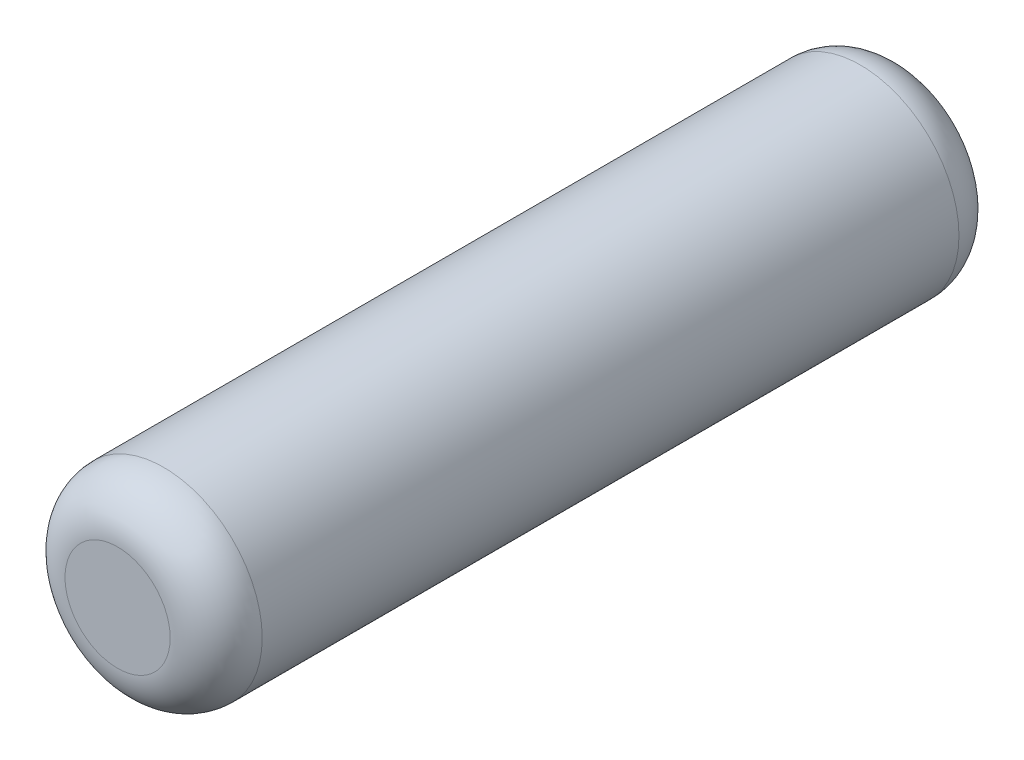
ISO-10303-21;
HEADER;
FILE_DESCRIPTION(('STEP AP214'),'2;1');
FILE_NAME('part.step','',(''),(''),'','','');
FILE_SCHEMA(('AUTOMOTIVE_DESIGN { 1 0 10303 214 1 1 1 1 }'));
ENDSEC;
DATA;
#1=APPLICATION_CONTEXT('core data for automotive mechanical design processes');
#2=APPLICATION_PROTOCOL_DEFINITION('international standard','automotive_design',2000,#1);
#3=PRODUCT_CONTEXT('',#1,'mechanical');
#4=PRODUCT('Part','Part','',(#3));
#5=PRODUCT_RELATED_PRODUCT_CATEGORY('part','',(#4));
#6=PRODUCT_DEFINITION_FORMATION('','',#4);
#7=PRODUCT_DEFINITION_CONTEXT('part definition',#1,'design');
#8=PRODUCT_DEFINITION('design','',#6,#7);
#9=PRODUCT_DEFINITION_SHAPE('','',#8);
#10=(LENGTH_UNIT() NAMED_UNIT(*) SI_UNIT(.MILLI.,.METRE.));
#11=(NAMED_UNIT(*) PLANE_ANGLE_UNIT() SI_UNIT($,.RADIAN.));
#12=(NAMED_UNIT(*) SI_UNIT($,.STERADIAN.) SOLID_ANGLE_UNIT());
#13=UNCERTAINTY_MEASURE_WITH_UNIT(LENGTH_MEASURE(1.E-05),#10,'distance_accuracy_value','');
#14=(GEOMETRIC_REPRESENTATION_CONTEXT(3) GLOBAL_UNCERTAINTY_ASSIGNED_CONTEXT((#13)) GLOBAL_UNIT_ASSIGNED_CONTEXT((#10,
#11,#12)) REPRESENTATION_CONTEXT('',''));
#15=CARTESIAN_POINT('',(0.,0.,0.));
#16=DIRECTION('',(0.,0.,1.));
#17=DIRECTION('',(1.,0.,0.));
#18=AXIS2_PLACEMENT_3D('',#15,#16,#17);
#19=CARTESIAN_POINT('',(0.,0.,3.));
#20=DIRECTION('',(0.,0.,-1.));
#21=DIRECTION('',(-1.,0.,0.));
#22=AXIS2_PLACEMENT_3D('',#19,#20,#21);
#23=CYLINDRICAL_SURFACE('',#22,0.75);
#24=CARTESIAN_POINT('',(0.,0.,-2.65));
#25=DIRECTION('',(0.,0.,1.));
#26=DIRECTION('',(1.,0.,0.));
#27=AXIS2_PLACEMENT_3D('',#24,#25,#26);
#28=CIRCLE('',#27,0.75);
#29=CARTESIAN_POINT('',(0.75,0.,-2.65));
#30=VERTEX_POINT('',#29);
#31=EDGE_CURVE('E42',#30,#30,#28,.T.);
#32=ORIENTED_EDGE('',*,*,#31,.T.);
#33=EDGE_LOOP('',(#32));
#34=FACE_BOUND('',#33,.T.);
#35=CARTESIAN_POINT('',(0.,0.,2.65));
#36=DIRECTION('',(0.,0.,1.));
#37=DIRECTION('',(1.,0.,0.));
#38=AXIS2_PLACEMENT_3D('',#35,#36,#37);
#39=CIRCLE('',#38,0.75);
#40=CARTESIAN_POINT('',(0.75,0.,2.65));
#41=VERTEX_POINT('',#40);
#42=EDGE_CURVE('E46',#41,#41,#39,.F.);
#43=ORIENTED_EDGE('',*,*,#42,.T.);
#44=EDGE_LOOP('',(#43));
#45=FACE_BOUND('',#44,.T.);
#46=ADVANCED_FACE('F31',(#34,#45),#23,.T.);
#47=CARTESIAN_POINT('',(0.,0.,3.));
#48=DIRECTION('',(0.,0.,1.));
#49=DIRECTION('',(1.,0.,0.));
#50=AXIS2_PLACEMENT_3D('',#47,#48,#49);
#51=PLANE('',#50);
#52=CARTESIAN_POINT('',(0.,0.,3.));
#53=DIRECTION('',(0.,0.,1.));
#54=DIRECTION('',(1.,0.,0.));
#55=AXIS2_PLACEMENT_3D('',#52,#53,#54);
#56=CIRCLE('',#55,0.4);
#57=CARTESIAN_POINT('',(0.4,0.,3.));
#58=VERTEX_POINT('',#57);
#59=EDGE_CURVE('E10',#58,#58,#56,.T.);
#60=ORIENTED_EDGE('',*,*,#59,.T.);
#61=EDGE_LOOP('',(#60));
#62=FACE_BOUND('',#61,.T.);
#63=ADVANCED_FACE('F62',(#62),#51,.T.);
#64=CARTESIAN_POINT('',(0.,0.,-3.));
#65=DIRECTION('',(0.,0.,1.));
#66=DIRECTION('',(1.,0.,0.));
#67=AXIS2_PLACEMENT_3D('',#64,#65,#66);
#68=PLANE('',#67);
#69=CARTESIAN_POINT('',(0.,0.,-3.));
#70=DIRECTION('',(0.,0.,1.));
#71=DIRECTION('',(1.,0.,0.));
#72=AXIS2_PLACEMENT_3D('',#69,#70,#71);
#73=CIRCLE('',#72,0.4);
#74=CARTESIAN_POINT('',(0.4,0.,-3.));
#75=VERTEX_POINT('',#74);
#76=EDGE_CURVE('E38',#75,#75,#73,.F.);
#77=ORIENTED_EDGE('',*,*,#76,.T.);
#78=EDGE_LOOP('',(#77));
#79=FACE_BOUND('',#78,.T.);
#80=ADVANCED_FACE('F59',(#79),#68,.F.);
#81=CARTESIAN_POINT('',(0.,0.,-2.65));
#82=DIRECTION('',(0.,0.,1.));
#83=DIRECTION('',(1.,0.,0.));
#84=AXIS2_PLACEMENT_3D('',#81,#82,#83);
#85=TOROIDAL_SURFACE('',#84,0.4,0.35);
#86=ORIENTED_EDGE('',*,*,#76,.F.);
#87=EDGE_LOOP('',(#86));
#88=FACE_BOUND('',#87,.T.);
#89=ORIENTED_EDGE('',*,*,#31,.F.);
#90=EDGE_LOOP('',(#89));
#91=FACE_BOUND('',#90,.T.);
#92=ADVANCED_FACE('F55',(#88,#91),#85,.T.);
#93=CARTESIAN_POINT('',(0.,0.,2.65));
#94=DIRECTION('',(0.,0.,1.));
#95=DIRECTION('',(1.,0.,0.));
#96=AXIS2_PLACEMENT_3D('',#93,#94,#95);
#97=TOROIDAL_SURFACE('',#96,0.4,0.35);
#98=ORIENTED_EDGE('',*,*,#42,.F.);
#99=EDGE_LOOP('',(#98));
#100=FACE_BOUND('',#99,.T.);
#101=ORIENTED_EDGE('',*,*,#59,.F.);
#102=EDGE_LOOP('',(#101));
#103=FACE_BOUND('',#102,.T.);
#104=ADVANCED_FACE('F33',(#100,#103),#97,.T.);
#105=CLOSED_SHELL('',(#46,#63,#80,#92,#104));
#106=MANIFOLD_SOLID_BREP('B2',#105);
#107=ADVANCED_BREP_SHAPE_REPRESENTATION('',(#18,#106),#14);
#108=SHAPE_DEFINITION_REPRESENTATION(#9,#107);
ENDSEC;
END-ISO-10303-21;
